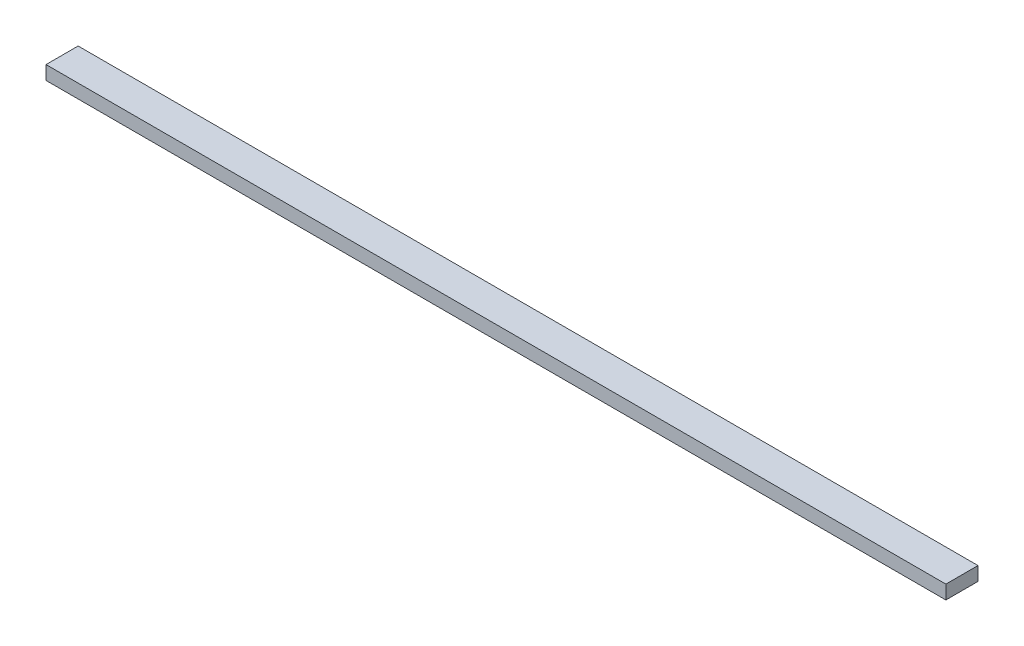
ISO-10303-21;
HEADER;
FILE_DESCRIPTION(('STEP AP214'),'2;1');
FILE_NAME('part.step','',(''),(''),'','','');
FILE_SCHEMA(('AUTOMOTIVE_DESIGN { 1 0 10303 214 1 1 1 1 }'));
ENDSEC;
DATA;
#1=APPLICATION_CONTEXT('core data for automotive mechanical design processes');
#2=APPLICATION_PROTOCOL_DEFINITION('international standard','automotive_design',2000,#1);
#3=PRODUCT_CONTEXT('',#1,'mechanical');
#4=PRODUCT('Part','Part','',(#3));
#5=PRODUCT_RELATED_PRODUCT_CATEGORY('part','',(#4));
#6=PRODUCT_DEFINITION_FORMATION('','',#4);
#7=PRODUCT_DEFINITION_CONTEXT('part definition',#1,'design');
#8=PRODUCT_DEFINITION('design','',#6,#7);
#9=PRODUCT_DEFINITION_SHAPE('','',#8);
#10=(LENGTH_UNIT() NAMED_UNIT(*) SI_UNIT(.MILLI.,.METRE.));
#11=(NAMED_UNIT(*) PLANE_ANGLE_UNIT() SI_UNIT($,.RADIAN.));
#12=(NAMED_UNIT(*) SI_UNIT($,.STERADIAN.) SOLID_ANGLE_UNIT());
#13=UNCERTAINTY_MEASURE_WITH_UNIT(LENGTH_MEASURE(1.E-05),#10,'distance_accuracy_value','');
#14=(GEOMETRIC_REPRESENTATION_CONTEXT(3) GLOBAL_UNCERTAINTY_ASSIGNED_CONTEXT((#13)) GLOBAL_UNIT_ASSIGNED_CONTEXT((#10,
#11,#12)) REPRESENTATION_CONTEXT('',''));
#15=CARTESIAN_POINT('',(0.,0.,0.));
#16=DIRECTION('',(0.,0.,1.));
#17=DIRECTION('',(1.,0.,0.));
#18=AXIS2_PLACEMENT_3D('',#15,#16,#17);
#19=CARTESIAN_POINT('',(0.,38.1,0.));
#20=DIRECTION('',(1.,0.,0.));
#21=DIRECTION('',(0.,0.,-1.));
#22=AXIS2_PLACEMENT_3D('',#19,#20,#21);
#23=PLANE('',#22);
#24=DIRECTION('',(0.,0.,1.));
#25=VECTOR('',#24,1.);
#26=CARTESIAN_POINT('',(0.,0.,0.));
#27=LINE('',#26,#25);
#28=CARTESIAN_POINT('',(0.,0.,0.));
#29=VERTEX_POINT('',#28);
#30=CARTESIAN_POINT('',(0.,0.,88.9));
#31=VERTEX_POINT('',#30);
#32=EDGE_CURVE('E96',#29,#31,#27,.T.);
#33=ORIENTED_EDGE('',*,*,#32,.T.);
#34=DIRECTION('',(0.,-1.,0.));
#35=VECTOR('',#34,1.);
#36=CARTESIAN_POINT('',(0.,38.1,88.9));
#37=LINE('',#36,#35);
#38=CARTESIAN_POINT('',(0.,38.1,88.9));
#39=VERTEX_POINT('',#38);
#40=EDGE_CURVE('E11',#39,#31,#37,.T.);
#41=ORIENTED_EDGE('',*,*,#40,.F.);
#42=DIRECTION('',(0.,0.,1.));
#43=VECTOR('',#42,1.);
#44=CARTESIAN_POINT('',(0.,38.1,0.));
#45=LINE('',#44,#43);
#46=CARTESIAN_POINT('',(0.,38.1,0.));
#47=VERTEX_POINT('',#46);
#48=EDGE_CURVE('E84',#47,#39,#45,.T.);
#49=ORIENTED_EDGE('',*,*,#48,.F.);
#50=DIRECTION('',(0.,-1.,0.));
#51=VECTOR('',#50,1.);
#52=CARTESIAN_POINT('',(0.,38.1,0.));
#53=LINE('',#52,#51);
#54=EDGE_CURVE('E92',#47,#29,#53,.T.);
#55=ORIENTED_EDGE('',*,*,#54,.T.);
#56=EDGE_LOOP('',(#33,#41,#49,#55));
#57=FACE_BOUND('',#56,.T.);
#58=ADVANCED_FACE('F33',(#57),#23,.F.);
#59=CARTESIAN_POINT('',(0.,38.1,88.9));
#60=DIRECTION('',(0.,0.,-1.));
#61=DIRECTION('',(-1.,0.,0.));
#62=AXIS2_PLACEMENT_3D('',#59,#60,#61);
#63=PLANE('',#62);
#64=DIRECTION('',(1.,0.,0.));
#65=VECTOR('',#64,1.);
#66=CARTESIAN_POINT('',(0.,0.,88.9));
#67=LINE('',#66,#65);
#68=CARTESIAN_POINT('',(2489.2,0.,88.9));
#69=VERTEX_POINT('',#68);
#70=EDGE_CURVE('E88',#31,#69,#67,.T.);
#71=ORIENTED_EDGE('',*,*,#70,.T.);
#72=DIRECTION('',(0.,-1.,0.));
#73=VECTOR('',#72,1.);
#74=CARTESIAN_POINT('',(2489.2,38.1,88.9));
#75=LINE('',#74,#73);
#76=CARTESIAN_POINT('',(2489.2,38.1,88.9));
#77=VERTEX_POINT('',#76);
#78=EDGE_CURVE('E41',#77,#69,#75,.T.);
#79=ORIENTED_EDGE('',*,*,#78,.F.);
#80=DIRECTION('',(1.,0.,0.));
#81=VECTOR('',#80,1.);
#82=CARTESIAN_POINT('',(0.,38.1,88.9));
#83=LINE('',#82,#81);
#84=EDGE_CURVE('E79',#39,#77,#83,.T.);
#85=ORIENTED_EDGE('',*,*,#84,.F.);
#86=ORIENTED_EDGE('',*,*,#40,.T.);
#87=EDGE_LOOP('',(#71,#79,#85,#86));
#88=FACE_BOUND('',#87,.T.);
#89=ADVANCED_FACE('F87',(#88),#63,.F.);
#90=CARTESIAN_POINT('',(2489.2,38.1,0.));
#91=DIRECTION('',(-1.,0.,0.));
#92=DIRECTION('',(0.,0.,1.));
#93=AXIS2_PLACEMENT_3D('',#90,#91,#92);
#94=PLANE('',#93);
#95=DIRECTION('',(0.,0.,-1.));
#96=VECTOR('',#95,1.);
#97=CARTESIAN_POINT('',(2489.2,0.,0.));
#98=LINE('',#97,#96);
#99=CARTESIAN_POINT('',(2489.2,0.,0.));
#100=VERTEX_POINT('',#99);
#101=EDGE_CURVE('E66',#69,#100,#98,.T.);
#102=ORIENTED_EDGE('',*,*,#101,.T.);
#103=DIRECTION('',(0.,-1.,0.));
#104=VECTOR('',#103,1.);
#105=CARTESIAN_POINT('',(2489.2,38.1,0.));
#106=LINE('',#105,#104);
#107=CARTESIAN_POINT('',(2489.2,38.1,0.));
#108=VERTEX_POINT('',#107);
#109=EDGE_CURVE('E89',#108,#100,#106,.T.);
#110=ORIENTED_EDGE('',*,*,#109,.F.);
#111=DIRECTION('',(0.,0.,-1.));
#112=VECTOR('',#111,1.);
#113=CARTESIAN_POINT('',(2489.2,38.1,0.));
#114=LINE('',#113,#112);
#115=EDGE_CURVE('E82',#77,#108,#114,.T.);
#116=ORIENTED_EDGE('',*,*,#115,.F.);
#117=ORIENTED_EDGE('',*,*,#78,.T.);
#118=EDGE_LOOP('',(#102,#110,#116,#117));
#119=FACE_BOUND('',#118,.T.);
#120=ADVANCED_FACE('F90',(#119),#94,.F.);
#121=CARTESIAN_POINT('',(0.,38.1,0.));
#122=DIRECTION('',(0.,0.,1.));
#123=DIRECTION('',(1.,0.,0.));
#124=AXIS2_PLACEMENT_3D('',#121,#122,#123);
#125=PLANE('',#124);
#126=DIRECTION('',(-1.,0.,0.));
#127=VECTOR('',#126,1.);
#128=CARTESIAN_POINT('',(0.,0.,0.));
#129=LINE('',#128,#127);
#130=EDGE_CURVE('E72',#100,#29,#129,.T.);
#131=ORIENTED_EDGE('',*,*,#130,.T.);
#132=ORIENTED_EDGE('',*,*,#54,.F.);
#133=DIRECTION('',(-1.,0.,0.));
#134=VECTOR('',#133,1.);
#135=CARTESIAN_POINT('',(0.,38.1,0.));
#136=LINE('',#135,#134);
#137=EDGE_CURVE('E49',#108,#47,#136,.T.);
#138=ORIENTED_EDGE('',*,*,#137,.F.);
#139=ORIENTED_EDGE('',*,*,#109,.T.);
#140=EDGE_LOOP('',(#131,#132,#138,#139));
#141=FACE_BOUND('',#140,.T.);
#142=ADVANCED_FACE('F103',(#141),#125,.F.);
#143=CARTESIAN_POINT('',(0.,38.1,0.));
#144=DIRECTION('',(0.,1.,0.));
#145=DIRECTION('',(0.,0.,1.));
#146=AXIS2_PLACEMENT_3D('',#143,#144,#145);
#147=PLANE('',#146);
#148=ORIENTED_EDGE('',*,*,#48,.T.);
#149=ORIENTED_EDGE('',*,*,#84,.T.);
#150=ORIENTED_EDGE('',*,*,#115,.T.);
#151=ORIENTED_EDGE('',*,*,#137,.T.);
#152=EDGE_LOOP('',(#148,#149,#150,#151));
#153=FACE_BOUND('',#152,.T.);
#154=ADVANCED_FACE('F80',(#153),#147,.T.);
#155=CARTESIAN_POINT('',(0.,0.,0.));
#156=DIRECTION('',(0.,1.,0.));
#157=DIRECTION('',(0.,0.,1.));
#158=AXIS2_PLACEMENT_3D('',#155,#156,#157);
#159=PLANE('',#158);
#160=ORIENTED_EDGE('',*,*,#32,.F.);
#161=ORIENTED_EDGE('',*,*,#130,.F.);
#162=ORIENTED_EDGE('',*,*,#101,.F.);
#163=ORIENTED_EDGE('',*,*,#70,.F.);
#164=EDGE_LOOP('',(#160,#161,#162,#163));
#165=FACE_BOUND('',#164,.T.);
#166=ADVANCED_FACE('F106',(#165),#159,.F.);
#167=CLOSED_SHELL('',(#58,#89,#120,#142,#154,#166));
#168=MANIFOLD_SOLID_BREP('B2',#167);
#169=ADVANCED_BREP_SHAPE_REPRESENTATION('',(#18,#168),#14);
#170=SHAPE_DEFINITION_REPRESENTATION(#9,#169);
ENDSEC;
END-ISO-10303-21;
